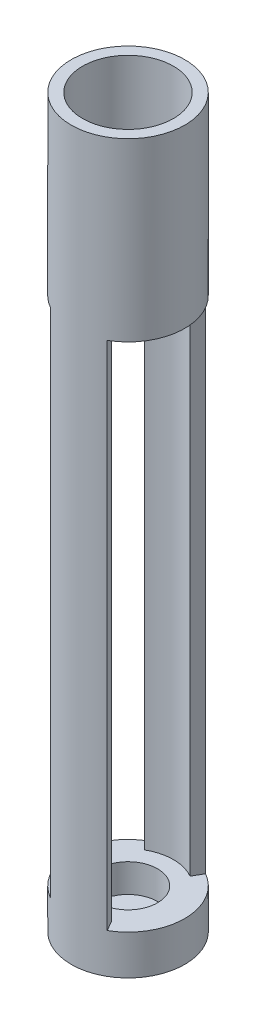
ISO-10303-21;
HEADER;
FILE_DESCRIPTION(('STEP AP214'),'2;1');
FILE_NAME('part.step','',(''),(''),'','','');
FILE_SCHEMA(('AUTOMOTIVE_DESIGN { 1 0 10303 214 1 1 1 1 }'));
ENDSEC;
DATA;
#1=APPLICATION_CONTEXT('core data for automotive mechanical design processes');
#2=APPLICATION_PROTOCOL_DEFINITION('international standard','automotive_design',2000,#1);
#3=PRODUCT_CONTEXT('',#1,'mechanical');
#4=PRODUCT('Part','Part','',(#3));
#5=PRODUCT_RELATED_PRODUCT_CATEGORY('part','',(#4));
#6=PRODUCT_DEFINITION_FORMATION('','',#4);
#7=PRODUCT_DEFINITION_CONTEXT('part definition',#1,'design');
#8=PRODUCT_DEFINITION('design','',#6,#7);
#9=PRODUCT_DEFINITION_SHAPE('','',#8);
#10=(LENGTH_UNIT() NAMED_UNIT(*) SI_UNIT(.MILLI.,.METRE.));
#11=(NAMED_UNIT(*) PLANE_ANGLE_UNIT() SI_UNIT($,.RADIAN.));
#12=(NAMED_UNIT(*) SI_UNIT($,.STERADIAN.) SOLID_ANGLE_UNIT());
#13=UNCERTAINTY_MEASURE_WITH_UNIT(LENGTH_MEASURE(1.E-05),#10,'distance_accuracy_value','');
#14=(GEOMETRIC_REPRESENTATION_CONTEXT(3) GLOBAL_UNCERTAINTY_ASSIGNED_CONTEXT((#13)) GLOBAL_UNIT_ASSIGNED_CONTEXT((#10,
#11,#12)) REPRESENTATION_CONTEXT('',''));
#15=CARTESIAN_POINT('',(0.,0.,0.));
#16=DIRECTION('',(0.,0.,1.));
#17=DIRECTION('',(1.,0.,0.));
#18=AXIS2_PLACEMENT_3D('',#15,#16,#17);
#19=CARTESIAN_POINT('',(0.,54.,0.));
#20=DIRECTION('',(0.,1.,0.));
#21=DIRECTION('',(0.,0.,1.));
#22=AXIS2_PLACEMENT_3D('',#19,#20,#21);
#23=PLANE('',#22);
#24=CARTESIAN_POINT('',(0.,54.,0.));
#25=DIRECTION('',(0.,1.,0.));
#26=DIRECTION('',(0.,0.,1.));
#27=AXIS2_PLACEMENT_3D('',#24,#25,#26);
#28=CIRCLE('',#27,2.6);
#29=CARTESIAN_POINT('',(0.,54.,2.6));
#30=VERTEX_POINT('',#29);
#31=EDGE_CURVE('E274',#30,#30,#28,.T.);
#32=ORIENTED_EDGE('',*,*,#31,.F.);
#33=EDGE_LOOP('',(#32));
#34=FACE_BOUND('',#33,.T.);
#35=CARTESIAN_POINT('',(0.,54.,3.));
#36=DIRECTION('',(0.,1.,0.));
#37=DIRECTION('',(0.,0.,1.));
#38=AXIS2_PLACEMENT_3D('',#35,#36,#37);
#39=CIRCLE('',#38,0.2);
#40=CARTESIAN_POINT('',(0.,54.,3.2));
#41=VERTEX_POINT('',#40);
#42=EDGE_CURVE('E306',#41,#41,#39,.F.);
#43=ORIENTED_EDGE('',*,*,#42,.T.);
#44=EDGE_LOOP('',(#43));
#45=FACE_BOUND('',#44,.T.);
#46=CARTESIAN_POINT('',(-2.59807621135332,54.,1.49999999999999));
#47=DIRECTION('',(0.,1.,0.));
#48=DIRECTION('',(0.,0.,1.));
#49=AXIS2_PLACEMENT_3D('',#46,#47,#48);
#50=CIRCLE('',#49,0.2);
#51=CARTESIAN_POINT('',(-2.59807621135332,54.,1.69999999999999));
#52=VERTEX_POINT('',#51);
#53=EDGE_CURVE('E340',#52,#52,#50,.F.);
#54=ORIENTED_EDGE('',*,*,#53,.T.);
#55=EDGE_LOOP('',(#54));
#56=FACE_BOUND('',#55,.T.);
#57=CARTESIAN_POINT('',(-2.59807621135331,54.,-1.50000000000001));
#58=DIRECTION('',(0.,1.,0.));
#59=DIRECTION('',(0.,0.,1.));
#60=AXIS2_PLACEMENT_3D('',#57,#58,#59);
#61=CIRCLE('',#60,0.2);
#62=CARTESIAN_POINT('',(-2.59807621135331,54.,-1.30000000000001));
#63=VERTEX_POINT('',#62);
#64=EDGE_CURVE('E344',#63,#63,#61,.F.);
#65=ORIENTED_EDGE('',*,*,#64,.T.);
#66=EDGE_LOOP('',(#65));
#67=FACE_BOUND('',#66,.T.);
#68=CARTESIAN_POINT('',(0.,54.,-3.));
#69=DIRECTION('',(0.,1.,0.));
#70=DIRECTION('',(0.,0.,1.));
#71=AXIS2_PLACEMENT_3D('',#68,#69,#70);
#72=CIRCLE('',#71,0.2);
#73=CARTESIAN_POINT('',(0.,54.,-2.8));
#74=VERTEX_POINT('',#73);
#75=EDGE_CURVE('E348',#74,#74,#72,.F.);
#76=ORIENTED_EDGE('',*,*,#75,.T.);
#77=EDGE_LOOP('',(#76));
#78=FACE_BOUND('',#77,.T.);
#79=CARTESIAN_POINT('',(2.59807621135333,54.,-1.49999999999998));
#80=DIRECTION('',(0.,1.,0.));
#81=DIRECTION('',(0.,0.,1.));
#82=AXIS2_PLACEMENT_3D('',#79,#80,#81);
#83=CIRCLE('',#82,0.2);
#84=CARTESIAN_POINT('',(2.59807621135333,54.,-1.29999999999998));
#85=VERTEX_POINT('',#84);
#86=EDGE_CURVE('E352',#85,#85,#83,.F.);
#87=ORIENTED_EDGE('',*,*,#86,.T.);
#88=EDGE_LOOP('',(#87));
#89=FACE_BOUND('',#88,.T.);
#90=CARTESIAN_POINT('',(2.5980762113533,54.,1.50000000000003));
#91=DIRECTION('',(0.,1.,0.));
#92=DIRECTION('',(0.,0.,1.));
#93=AXIS2_PLACEMENT_3D('',#90,#91,#92);
#94=CIRCLE('',#93,0.2);
#95=CARTESIAN_POINT('',(2.5980762113533,54.,1.70000000000003));
#96=VERTEX_POINT('',#95);
#97=EDGE_CURVE('E356',#96,#96,#94,.F.);
#98=ORIENTED_EDGE('',*,*,#97,.T.);
#99=EDGE_LOOP('',(#98));
#100=FACE_BOUND('',#99,.T.);
#101=CARTESIAN_POINT('',(0.,54.,0.));
#102=DIRECTION('',(0.,1.,0.));
#103=DIRECTION('',(0.,0.,1.));
#104=AXIS2_PLACEMENT_3D('',#101,#102,#103);
#105=CIRCLE('',#104,4.);
#106=CARTESIAN_POINT('',(0.,54.,4.));
#107=VERTEX_POINT('',#106);
#108=EDGE_CURVE('E11',#107,#107,#105,.F.);
#109=ORIENTED_EDGE('',*,*,#108,.F.);
#110=EDGE_LOOP('',(#109));
#111=FACE_BOUND('',#110,.T.);
#112=ADVANCED_FACE('F43',(#34,#45,#56,#67,#78,#89,#100,#111),#23,.T.);
#113=CARTESIAN_POINT('',(0.,51.5,0.));
#114=DIRECTION('',(0.,1.,0.));
#115=DIRECTION('',(0.,0.,1.));
#116=AXIS2_PLACEMENT_3D('',#113,#114,#115);
#117=PLANE('',#116);
#118=CARTESIAN_POINT('',(0.,51.5,0.));
#119=DIRECTION('',(0.,1.,0.));
#120=DIRECTION('',(0.,0.,1.));
#121=AXIS2_PLACEMENT_3D('',#118,#119,#120);
#122=CIRCLE('',#121,1.3);
#123=CARTESIAN_POINT('',(0.,51.5,1.3));
#124=VERTEX_POINT('',#123);
#125=EDGE_CURVE('E146',#124,#124,#122,.T.);
#126=ORIENTED_EDGE('',*,*,#125,.F.);
#127=EDGE_LOOP('',(#126));
#128=FACE_BOUND('',#127,.T.);
#129=CARTESIAN_POINT('',(0.,51.5,0.));
#130=DIRECTION('',(0.,1.,0.));
#131=DIRECTION('',(0.,0.,1.));
#132=AXIS2_PLACEMENT_3D('',#129,#130,#131);
#133=CIRCLE('',#132,2.6);
#134=CARTESIAN_POINT('',(0.,51.5,2.6));
#135=VERTEX_POINT('',#134);
#136=EDGE_CURVE('E278',#135,#135,#133,.T.);
#137=ORIENTED_EDGE('',*,*,#136,.T.);
#138=EDGE_LOOP('',(#137));
#139=FACE_BOUND('',#138,.T.);
#140=ADVANCED_FACE('F246',(#128,#139),#117,.T.);
#141=CARTESIAN_POINT('',(0.,3.5,0.));
#142=DIRECTION('',(0.,1.,0.));
#143=DIRECTION('',(0.,0.,1.));
#144=AXIS2_PLACEMENT_3D('',#141,#142,#143);
#145=PLANE('',#144);
#146=DIRECTION('',(-0.5,0.,0.866025403784439));
#147=VECTOR('',#146,1.);
#148=CARTESIAN_POINT('',(0.,3.5,0.));
#149=LINE('',#148,#147);
#150=CARTESIAN_POINT('',(2.5,3.5,-4.33012701892219));
#151=VERTEX_POINT('',#150);
#152=CARTESIAN_POINT('',(2.,3.5,-3.46410161513775));
#153=VERTEX_POINT('',#152);
#154=EDGE_CURVE('E59',#151,#153,#149,.T.);
#155=ORIENTED_EDGE('',*,*,#154,.T.);
#156=CARTESIAN_POINT('',(0.,3.5,0.));
#157=DIRECTION('',(0.,1.,0.));
#158=DIRECTION('',(0.,0.,1.));
#159=AXIS2_PLACEMENT_3D('',#156,#157,#158);
#160=CIRCLE('',#159,4.);
#161=CARTESIAN_POINT('',(-2.,3.5,-3.46410161513775));
#162=VERTEX_POINT('',#161);
#163=EDGE_CURVE('E64',#153,#162,#160,.T.);
#164=ORIENTED_EDGE('',*,*,#163,.T.);
#165=DIRECTION('',(0.5,0.,0.866025403784439));
#166=VECTOR('',#165,1.);
#167=CARTESIAN_POINT('',(0.,3.5,0.));
#168=LINE('',#167,#166);
#169=CARTESIAN_POINT('',(-2.5,3.5,-4.33012701892219));
#170=VERTEX_POINT('',#169);
#171=EDGE_CURVE('E155',#170,#162,#168,.T.);
#172=ORIENTED_EDGE('',*,*,#171,.F.);
#173=CARTESIAN_POINT('',(0.,3.5,0.));
#174=DIRECTION('',(0.,1.,0.));
#175=DIRECTION('',(0.,0.,1.));
#176=AXIS2_PLACEMENT_3D('',#173,#174,#175);
#177=CIRCLE('',#176,5.);
#178=CARTESIAN_POINT('',(-2.5,3.5,4.33012701892219));
#179=VERTEX_POINT('',#178);
#180=EDGE_CURVE('E213',#170,#179,#177,.T.);
#181=ORIENTED_EDGE('',*,*,#180,.T.);
#182=DIRECTION('',(0.5,0.,-0.866025403784439));
#183=VECTOR('',#182,1.);
#184=CARTESIAN_POINT('',(0.,3.5,0.));
#185=LINE('',#184,#183);
#186=CARTESIAN_POINT('',(-2.,3.5,3.46410161513775));
#187=VERTEX_POINT('',#186);
#188=EDGE_CURVE('E122',#179,#187,#185,.T.);
#189=ORIENTED_EDGE('',*,*,#188,.T.);
#190=CARTESIAN_POINT('',(0.,3.5,0.));
#191=DIRECTION('',(0.,1.,0.));
#192=DIRECTION('',(0.,0.,1.));
#193=AXIS2_PLACEMENT_3D('',#190,#191,#192);
#194=CIRCLE('',#193,4.);
#195=CARTESIAN_POINT('',(2.,3.5,3.46410161513775));
#196=VERTEX_POINT('',#195);
#197=EDGE_CURVE('E188',#196,#187,#194,.F.);
#198=ORIENTED_EDGE('',*,*,#197,.F.);
#199=DIRECTION('',(-0.5,0.,-0.866025403784439));
#200=VECTOR('',#199,1.);
#201=CARTESIAN_POINT('',(0.,3.5,0.));
#202=LINE('',#201,#200);
#203=CARTESIAN_POINT('',(2.5,3.5,4.33012701892219));
#204=VERTEX_POINT('',#203);
#205=EDGE_CURVE('E179',#204,#196,#202,.T.);
#206=ORIENTED_EDGE('',*,*,#205,.F.);
#207=EDGE_CURVE('E52',#204,#151,#177,.T.);
#208=ORIENTED_EDGE('',*,*,#207,.T.);
#209=EDGE_LOOP('',(#155,#164,#172,#181,#189,#198,#206,#208));
#210=FACE_BOUND('',#209,.T.);
#211=CARTESIAN_POINT('',(0.,3.5,0.));
#212=DIRECTION('',(0.,1.,0.));
#213=DIRECTION('',(0.,0.,1.));
#214=AXIS2_PLACEMENT_3D('',#211,#212,#213);
#215=CIRCLE('',#214,2.6);
#216=CARTESIAN_POINT('',(0.,3.5,2.6));
#217=VERTEX_POINT('',#216);
#218=EDGE_CURVE('E203',#217,#217,#215,.T.);
#219=ORIENTED_EDGE('',*,*,#218,.F.);
#220=EDGE_LOOP('',(#219));
#221=FACE_BOUND('',#220,.T.);
#222=ADVANCED_FACE('F219',(#210,#221),#145,.T.);
#223=CARTESIAN_POINT('',(0.,3.5,0.));
#224=DIRECTION('',(0.,-1.,0.));
#225=DIRECTION('',(0.,0.,-1.));
#226=AXIS2_PLACEMENT_3D('',#223,#224,#225);
#227=CYLINDRICAL_SURFACE('',#226,5.);
#228=DIRECTION('',(0.,-1.,0.));
#229=VECTOR('',#228,1.);
#230=CARTESIAN_POINT('',(2.5,48.5,4.33012701892219));
#231=LINE('',#230,#229);
#232=CARTESIAN_POINT('',(2.5,48.5,4.33012701892219));
#233=VERTEX_POINT('',#232);
#234=EDGE_CURVE('E114',#233,#204,#231,.T.);
#235=ORIENTED_EDGE('',*,*,#234,.F.);
#236=CARTESIAN_POINT('',(0.,48.5,0.));
#237=DIRECTION('',(0.,1.,0.));
#238=DIRECTION('',(0.,0.,1.));
#239=AXIS2_PLACEMENT_3D('',#236,#237,#238);
#240=CIRCLE('',#239,5.);
#241=CARTESIAN_POINT('',(2.5,48.5,-4.33012701892219));
#242=VERTEX_POINT('',#241);
#243=EDGE_CURVE('E129',#233,#242,#240,.T.);
#244=ORIENTED_EDGE('',*,*,#243,.T.);
#245=DIRECTION('',(0.,-1.,0.));
#246=VECTOR('',#245,1.);
#247=CARTESIAN_POINT('',(2.5,48.5,-4.33012701892219));
#248=LINE('',#247,#246);
#249=EDGE_CURVE('E174',#242,#151,#248,.T.);
#250=ORIENTED_EDGE('',*,*,#249,.T.);
#251=ORIENTED_EDGE('',*,*,#207,.F.);
#252=EDGE_LOOP('',(#235,#244,#250,#251));
#253=FACE_BOUND('',#252,.T.);
#254=CARTESIAN_POINT('',(-2.5,48.5,-4.33012701892219));
#255=VERTEX_POINT('',#254);
#256=CARTESIAN_POINT('',(-2.5,48.5,4.33012701892219));
#257=VERTEX_POINT('',#256);
#258=EDGE_CURVE('E140',#255,#257,#240,.T.);
#259=ORIENTED_EDGE('',*,*,#258,.T.);
#260=DIRECTION('',(0.,-1.,0.));
#261=VECTOR('',#260,1.);
#262=CARTESIAN_POINT('',(-2.5,48.5,4.33012701892219));
#263=LINE('',#262,#261);
#264=EDGE_CURVE('E131',#257,#179,#263,.T.);
#265=ORIENTED_EDGE('',*,*,#264,.T.);
#266=ORIENTED_EDGE('',*,*,#180,.F.);
#267=DIRECTION('',(0.,-1.,0.));
#268=VECTOR('',#267,1.);
#269=CARTESIAN_POINT('',(-2.5,48.5,-4.33012701892219));
#270=LINE('',#269,#268);
#271=EDGE_CURVE('E170',#255,#170,#270,.T.);
#272=ORIENTED_EDGE('',*,*,#271,.F.);
#273=EDGE_LOOP('',(#259,#265,#266,#272));
#274=FACE_BOUND('',#273,.T.);
#275=CARTESIAN_POINT('',(0.,0.,0.));
#276=DIRECTION('',(0.,1.,0.));
#277=DIRECTION('',(0.,0.,1.));
#278=AXIS2_PLACEMENT_3D('',#275,#276,#277);
#279=CIRCLE('',#278,5.);
#280=CARTESIAN_POINT('',(0.,0.,5.));
#281=VERTEX_POINT('',#280);
#282=EDGE_CURVE('E208',#281,#281,#279,.T.);
#283=ORIENTED_EDGE('',*,*,#282,.T.);
#284=EDGE_LOOP('',(#283));
#285=FACE_BOUND('',#284,.T.);
#286=CARTESIAN_POINT('',(0.,64.,0.));
#287=DIRECTION('',(0.,1.,0.));
#288=DIRECTION('',(0.,0.,1.));
#289=AXIS2_PLACEMENT_3D('',#286,#287,#288);
#290=CIRCLE('',#289,5.);
#291=CARTESIAN_POINT('',(0.,64.,5.));
#292=VERTEX_POINT('',#291);
#293=EDGE_CURVE('E370',#292,#292,#290,.T.);
#294=ORIENTED_EDGE('',*,*,#293,.F.);
#295=EDGE_LOOP('',(#294));
#296=FACE_BOUND('',#295,.T.);
#297=ADVANCED_FACE('F45',(#253,#274,#285,#296),#227,.T.);
#298=CARTESIAN_POINT('',(0.,0.,0.));
#299=DIRECTION('',(0.,1.,0.));
#300=DIRECTION('',(0.,0.,1.));
#301=AXIS2_PLACEMENT_3D('',#298,#299,#300);
#302=PLANE('',#301);
#303=ORIENTED_EDGE('',*,*,#282,.F.);
#304=EDGE_LOOP('',(#303));
#305=FACE_BOUND('',#304,.T.);
#306=ADVANCED_FACE('F560',(#305),#302,.F.);
#307=CARTESIAN_POINT('',(0.,1.,0.));
#308=DIRECTION('',(0.,1.,0.));
#309=DIRECTION('',(0.,0.,1.));
#310=AXIS2_PLACEMENT_3D('',#307,#308,#309);
#311=CYLINDRICAL_SURFACE('',#310,2.6);
#312=CARTESIAN_POINT('',(0.,1.,0.));
#313=DIRECTION('',(0.,1.,0.));
#314=DIRECTION('',(0.,0.,1.));
#315=AXIS2_PLACEMENT_3D('',#312,#313,#314);
#316=CIRCLE('',#315,2.6);
#317=CARTESIAN_POINT('',(0.,1.,2.6));
#318=VERTEX_POINT('',#317);
#319=EDGE_CURVE('E204',#318,#318,#316,.T.);
#320=ORIENTED_EDGE('',*,*,#319,.F.);
#321=EDGE_LOOP('',(#320));
#322=FACE_BOUND('',#321,.T.);
#323=ORIENTED_EDGE('',*,*,#218,.T.);
#324=EDGE_LOOP('',(#323));
#325=FACE_BOUND('',#324,.T.);
#326=ADVANCED_FACE('F582',(#322,#325),#311,.F.);
#327=CARTESIAN_POINT('',(0.,1.,0.));
#328=DIRECTION('',(0.,1.,0.));
#329=DIRECTION('',(0.,0.,1.));
#330=AXIS2_PLACEMENT_3D('',#327,#328,#329);
#331=PLANE('',#330);
#332=ORIENTED_EDGE('',*,*,#319,.T.);
#333=EDGE_LOOP('',(#332));
#334=FACE_BOUND('',#333,.T.);
#335=ADVANCED_FACE('F589',(#334),#331,.T.);
#336=CARTESIAN_POINT('',(0.,48.5,0.));
#337=DIRECTION('',(-0.866025403784439,0.,0.5));
#338=DIRECTION('',(0.5,0.,0.866025403784439));
#339=AXIS2_PLACEMENT_3D('',#336,#337,#338);
#340=PLANE('',#339);
#341=ORIENTED_EDGE('',*,*,#205,.T.);
#342=DIRECTION('',(0.,-1.,0.));
#343=VECTOR('',#342,1.);
#344=CARTESIAN_POINT('',(2.,48.5,3.46410161513775));
#345=LINE('',#344,#343);
#346=CARTESIAN_POINT('',(2.,48.5,3.46410161513775));
#347=VERTEX_POINT('',#346);
#348=EDGE_CURVE('E116',#347,#196,#345,.T.);
#349=ORIENTED_EDGE('',*,*,#348,.F.);
#350=DIRECTION('',(-0.5,0.,-0.866025403784439));
#351=VECTOR('',#350,1.);
#352=CARTESIAN_POINT('',(0.,48.5,0.));
#353=LINE('',#352,#351);
#354=EDGE_CURVE('E110',#233,#347,#353,.T.);
#355=ORIENTED_EDGE('',*,*,#354,.F.);
#356=ORIENTED_EDGE('',*,*,#234,.T.);
#357=EDGE_LOOP('',(#341,#349,#355,#356));
#358=FACE_BOUND('',#357,.T.);
#359=ADVANCED_FACE('F113',(#358),#340,.F.);
#360=CARTESIAN_POINT('',(0.,48.5,0.));
#361=DIRECTION('',(0.,-1.,0.));
#362=DIRECTION('',(0.,0.,-1.));
#363=AXIS2_PLACEMENT_3D('',#360,#361,#362);
#364=CYLINDRICAL_SURFACE('',#363,4.);
#365=ORIENTED_EDGE('',*,*,#197,.T.);
#366=DIRECTION('',(0.,-1.,0.));
#367=VECTOR('',#366,1.);
#368=CARTESIAN_POINT('',(-2.,48.5,3.46410161513775));
#369=LINE('',#368,#367);
#370=CARTESIAN_POINT('',(-2.,48.5,3.46410161513775));
#371=VERTEX_POINT('',#370);
#372=EDGE_CURVE('E197',#371,#187,#369,.T.);
#373=ORIENTED_EDGE('',*,*,#372,.F.);
#374=CARTESIAN_POINT('',(0.,48.5,0.));
#375=DIRECTION('',(0.,1.,0.));
#376=DIRECTION('',(0.,0.,1.));
#377=AXIS2_PLACEMENT_3D('',#374,#375,#376);
#378=CIRCLE('',#377,4.);
#379=EDGE_CURVE('E121',#347,#371,#378,.F.);
#380=ORIENTED_EDGE('',*,*,#379,.F.);
#381=ORIENTED_EDGE('',*,*,#348,.T.);
#382=EDGE_LOOP('',(#365,#373,#380,#381));
#383=FACE_BOUND('',#382,.T.);
#384=ADVANCED_FACE('F228',(#383),#364,.F.);
#385=CARTESIAN_POINT('',(0.,48.5,0.));
#386=DIRECTION('',(-0.866025403784439,0.,-0.5));
#387=DIRECTION('',(-0.5,0.,0.866025403784439));
#388=AXIS2_PLACEMENT_3D('',#385,#386,#387);
#389=PLANE('',#388);
#390=ORIENTED_EDGE('',*,*,#188,.F.);
#391=ORIENTED_EDGE('',*,*,#264,.F.);
#392=DIRECTION('',(0.5,0.,-0.866025403784439));
#393=VECTOR('',#392,1.);
#394=CARTESIAN_POINT('',(0.,48.5,0.));
#395=LINE('',#394,#393);
#396=EDGE_CURVE('E132',#257,#371,#395,.T.);
#397=ORIENTED_EDGE('',*,*,#396,.T.);
#398=ORIENTED_EDGE('',*,*,#372,.T.);
#399=EDGE_LOOP('',(#390,#391,#397,#398));
#400=FACE_BOUND('',#399,.T.);
#401=ADVANCED_FACE('F226',(#400),#389,.T.);
#402=CARTESIAN_POINT('',(0.,48.5,0.));
#403=DIRECTION('',(0.,-1.,0.));
#404=DIRECTION('',(0.,0.,-1.));
#405=AXIS2_PLACEMENT_3D('',#402,#403,#404);
#406=CYLINDRICAL_SURFACE('',#405,4.);
#407=ORIENTED_EDGE('',*,*,#163,.F.);
#408=DIRECTION('',(0.,-1.,0.));
#409=VECTOR('',#408,1.);
#410=CARTESIAN_POINT('',(2.,48.5,-3.46410161513775));
#411=LINE('',#410,#409);
#412=CARTESIAN_POINT('',(2.,48.5,-3.46410161513775));
#413=VERTEX_POINT('',#412);
#414=EDGE_CURVE('E177',#413,#153,#411,.T.);
#415=ORIENTED_EDGE('',*,*,#414,.F.);
#416=CARTESIAN_POINT('',(0.,48.5,0.));
#417=DIRECTION('',(0.,1.,0.));
#418=DIRECTION('',(0.,0.,1.));
#419=AXIS2_PLACEMENT_3D('',#416,#417,#418);
#420=CIRCLE('',#419,4.);
#421=CARTESIAN_POINT('',(-2.,48.5,-3.46410161513775));
#422=VERTEX_POINT('',#421);
#423=EDGE_CURVE('E151',#413,#422,#420,.T.);
#424=ORIENTED_EDGE('',*,*,#423,.T.);
#425=DIRECTION('',(0.,-1.,0.));
#426=VECTOR('',#425,1.);
#427=CARTESIAN_POINT('',(-2.,48.5,-3.46410161513775));
#428=LINE('',#427,#426);
#429=EDGE_CURVE('E161',#422,#162,#428,.T.);
#430=ORIENTED_EDGE('',*,*,#429,.T.);
#431=EDGE_LOOP('',(#407,#415,#424,#430));
#432=FACE_BOUND('',#431,.T.);
#433=ADVANCED_FACE('F232',(#432),#406,.F.);
#434=CARTESIAN_POINT('',(0.,48.5,0.));
#435=DIRECTION('',(0.866025403784439,0.,0.5));
#436=DIRECTION('',(0.5,0.,-0.866025403784439));
#437=AXIS2_PLACEMENT_3D('',#434,#435,#436);
#438=PLANE('',#437);
#439=ORIENTED_EDGE('',*,*,#154,.F.);
#440=ORIENTED_EDGE('',*,*,#249,.F.);
#441=DIRECTION('',(-0.5,0.,0.866025403784439));
#442=VECTOR('',#441,1.);
#443=CARTESIAN_POINT('',(0.,48.5,0.));
#444=LINE('',#443,#442);
#445=EDGE_CURVE('E138',#242,#413,#444,.T.);
#446=ORIENTED_EDGE('',*,*,#445,.T.);
#447=ORIENTED_EDGE('',*,*,#414,.T.);
#448=EDGE_LOOP('',(#439,#440,#446,#447));
#449=FACE_BOUND('',#448,.T.);
#450=ADVANCED_FACE('F230',(#449),#438,.T.);
#451=CARTESIAN_POINT('',(0.,48.5,0.));
#452=DIRECTION('',(0.866025403784439,0.,-0.5));
#453=DIRECTION('',(-0.5,0.,-0.866025403784439));
#454=AXIS2_PLACEMENT_3D('',#451,#452,#453);
#455=PLANE('',#454);
#456=ORIENTED_EDGE('',*,*,#171,.T.);
#457=ORIENTED_EDGE('',*,*,#429,.F.);
#458=DIRECTION('',(0.5,0.,0.866025403784439));
#459=VECTOR('',#458,1.);
#460=CARTESIAN_POINT('',(0.,48.5,0.));
#461=LINE('',#460,#459);
#462=EDGE_CURVE('E158',#255,#422,#461,.T.);
#463=ORIENTED_EDGE('',*,*,#462,.F.);
#464=ORIENTED_EDGE('',*,*,#271,.T.);
#465=EDGE_LOOP('',(#456,#457,#463,#464));
#466=FACE_BOUND('',#465,.T.);
#467=ADVANCED_FACE('F234',(#466),#455,.F.);
#468=CARTESIAN_POINT('',(0.,48.5,0.));
#469=DIRECTION('',(0.,1.,0.));
#470=DIRECTION('',(0.,0.,1.));
#471=AXIS2_PLACEMENT_3D('',#468,#469,#470);
#472=PLANE('',#471);
#473=CARTESIAN_POINT('',(2.16506350946108,48.5,1.25000000000003));
#474=DIRECTION('',(0.,-1.,0.));
#475=DIRECTION('',(-0.866025403784433,0.,-0.50000000000001));
#476=AXIS2_PLACEMENT_3D('',#473,#474,#475);
#477=CIRCLE('',#476,1.);
#478=CARTESIAN_POINT('',(1.29903810567665,48.5,0.750000000000015));
#479=VERTEX_POINT('',#478);
#480=EDGE_CURVE('E301',#479,#479,#477,.T.);
#481=ORIENTED_EDGE('',*,*,#480,.F.);
#482=EDGE_LOOP('',(#481));
#483=FACE_BOUND('',#482,.T.);
#484=CARTESIAN_POINT('',(2.16506350946111,48.5,-1.24999999999998));
#485=DIRECTION('',(0.,-1.,0.));
#486=DIRECTION('',(-0.866025403784443,0.,0.499999999999992));
#487=AXIS2_PLACEMENT_3D('',#484,#485,#486);
#488=CIRCLE('',#487,1.);
#489=CARTESIAN_POINT('',(1.29903810567667,48.5,-0.749999999999988));
#490=VERTEX_POINT('',#489);
#491=EDGE_CURVE('E310',#490,#490,#488,.T.);
#492=ORIENTED_EDGE('',*,*,#491,.F.);
#493=EDGE_LOOP('',(#492));
#494=FACE_BOUND('',#493,.T.);
#495=CARTESIAN_POINT('',(0.,48.5,-2.5));
#496=DIRECTION('',(0.,-1.,0.));
#497=DIRECTION('',(0.,0.,1.));
#498=AXIS2_PLACEMENT_3D('',#495,#496,#497);
#499=CIRCLE('',#498,1.);
#500=CARTESIAN_POINT('',(0.,48.5,-1.5));
#501=VERTEX_POINT('',#500);
#502=EDGE_CURVE('E318',#501,#501,#499,.T.);
#503=ORIENTED_EDGE('',*,*,#502,.F.);
#504=EDGE_LOOP('',(#503));
#505=FACE_BOUND('',#504,.T.);
#506=CARTESIAN_POINT('',(-2.16506350946109,48.5,-1.25000000000001));
#507=DIRECTION('',(0.,-1.,0.));
#508=DIRECTION('',(0.866025403784436,0.,0.500000000000004));
#509=AXIS2_PLACEMENT_3D('',#506,#507,#508);
#510=CIRCLE('',#509,1.);
#511=CARTESIAN_POINT('',(-1.29903810567665,48.5,-0.750000000000006));
#512=VERTEX_POINT('',#511);
#513=EDGE_CURVE('E326',#512,#512,#510,.T.);
#514=ORIENTED_EDGE('',*,*,#513,.F.);
#515=EDGE_LOOP('',(#514));
#516=FACE_BOUND('',#515,.T.);
#517=CARTESIAN_POINT('',(-2.1650635094611,48.5,1.25));
#518=DIRECTION('',(0.,-1.,0.));
#519=DIRECTION('',(0.86602540378444,0.,-0.499999999999998));
#520=AXIS2_PLACEMENT_3D('',#517,#518,#519);
#521=CIRCLE('',#520,1.);
#522=CARTESIAN_POINT('',(-1.29903810567666,48.5,0.749999999999997));
#523=VERTEX_POINT('',#522);
#524=EDGE_CURVE('E293',#523,#523,#521,.T.);
#525=ORIENTED_EDGE('',*,*,#524,.F.);
#526=EDGE_LOOP('',(#525));
#527=FACE_BOUND('',#526,.T.);
#528=CARTESIAN_POINT('',(0.,48.5,2.5));
#529=DIRECTION('',(0.,-1.,0.));
#530=DIRECTION('',(0.,0.,-1.));
#531=AXIS2_PLACEMENT_3D('',#528,#529,#530);
#532=CIRCLE('',#531,1.);
#533=CARTESIAN_POINT('',(0.,48.5,1.5));
#534=VERTEX_POINT('',#533);
#535=EDGE_CURVE('E285',#534,#534,#532,.T.);
#536=ORIENTED_EDGE('',*,*,#535,.F.);
#537=EDGE_LOOP('',(#536));
#538=FACE_BOUND('',#537,.T.);
#539=CARTESIAN_POINT('',(0.,48.5,0.));
#540=DIRECTION('',(0.,1.,0.));
#541=DIRECTION('',(0.,0.,1.));
#542=AXIS2_PLACEMENT_3D('',#539,#540,#541);
#543=CIRCLE('',#542,1.3);
#544=CARTESIAN_POINT('',(0.,48.5,1.3));
#545=VERTEX_POINT('',#544);
#546=EDGE_CURVE('E149',#545,#545,#543,.T.);
#547=ORIENTED_EDGE('',*,*,#546,.T.);
#548=EDGE_LOOP('',(#547));
#549=FACE_BOUND('',#548,.T.);
#550=ORIENTED_EDGE('',*,*,#243,.F.);
#551=ORIENTED_EDGE('',*,*,#354,.T.);
#552=ORIENTED_EDGE('',*,*,#379,.T.);
#553=ORIENTED_EDGE('',*,*,#396,.F.);
#554=ORIENTED_EDGE('',*,*,#258,.F.);
#555=ORIENTED_EDGE('',*,*,#462,.T.);
#556=ORIENTED_EDGE('',*,*,#423,.F.);
#557=ORIENTED_EDGE('',*,*,#445,.F.);
#558=EDGE_LOOP('',(#550,#551,#552,#553,#554,#555,#556,#557));
#559=FACE_BOUND('',#558,.T.);
#560=ADVANCED_FACE('F135',(#483,#494,#505,#516,#527,#538,#549,#559),#472,.F.);
#561=CARTESIAN_POINT('',(0.,51.5,0.));
#562=DIRECTION('',(0.,-1.,0.));
#563=DIRECTION('',(0.,0.,-1.));
#564=AXIS2_PLACEMENT_3D('',#561,#562,#563);
#565=CYLINDRICAL_SURFACE('',#564,1.3);
#566=ORIENTED_EDGE('',*,*,#125,.T.);
#567=EDGE_LOOP('',(#566));
#568=FACE_BOUND('',#567,.T.);
#569=ORIENTED_EDGE('',*,*,#546,.F.);
#570=EDGE_LOOP('',(#569));
#571=FACE_BOUND('',#570,.T.);
#572=ADVANCED_FACE('F241',(#568,#571),#565,.F.);
#573=CARTESIAN_POINT('',(0.,54.,0.));
#574=DIRECTION('',(0.,-1.,0.));
#575=DIRECTION('',(0.,0.,-1.));
#576=AXIS2_PLACEMENT_3D('',#573,#574,#575);
#577=CYLINDRICAL_SURFACE('',#576,2.6);
#578=ORIENTED_EDGE('',*,*,#31,.T.);
#579=EDGE_LOOP('',(#578));
#580=FACE_BOUND('',#579,.T.);
#581=ORIENTED_EDGE('',*,*,#136,.F.);
#582=EDGE_LOOP('',(#581));
#583=FACE_BOUND('',#582,.T.);
#584=ADVANCED_FACE('F258',(#580,#583),#577,.F.);
#585=CARTESIAN_POINT('',(0.,50.5,2.5));
#586=DIRECTION('',(0.,-1.,0.));
#587=DIRECTION('',(0.,0.,-1.));
#588=AXIS2_PLACEMENT_3D('',#585,#586,#587);
#589=CYLINDRICAL_SURFACE('',#588,1.);
#590=CARTESIAN_POINT('',(0.,50.5,2.5));
#591=DIRECTION('',(0.,-1.,0.));
#592=DIRECTION('',(0.,0.,-1.));
#593=AXIS2_PLACEMENT_3D('',#590,#591,#592);
#594=CIRCLE('',#593,1.);
#595=CARTESIAN_POINT('',(0.,50.5,1.5));
#596=VERTEX_POINT('',#595);
#597=EDGE_CURVE('E282',#596,#596,#594,.T.);
#598=ORIENTED_EDGE('',*,*,#597,.F.);
#599=EDGE_LOOP('',(#598));
#600=FACE_BOUND('',#599,.T.);
#601=ORIENTED_EDGE('',*,*,#535,.T.);
#602=EDGE_LOOP('',(#601));
#603=FACE_BOUND('',#602,.T.);
#604=ADVANCED_FACE('F265',(#600,#603),#589,.F.);
#605=CARTESIAN_POINT('',(0.,50.5,2.5));
#606=DIRECTION('',(0.,-1.,0.));
#607=DIRECTION('',(0.,0.,-1.));
#608=AXIS2_PLACEMENT_3D('',#605,#606,#607);
#609=PLANE('',#608);
#610=CARTESIAN_POINT('',(0.,50.5,3.));
#611=DIRECTION('',(0.,-1.,0.));
#612=DIRECTION('',(0.,0.,-1.));
#613=AXIS2_PLACEMENT_3D('',#610,#611,#612);
#614=CIRCLE('',#613,0.2);
#615=CARTESIAN_POINT('',(0.,50.5,2.8));
#616=VERTEX_POINT('',#615);
#617=EDGE_CURVE('E336',#616,#616,#614,.F.);
#618=ORIENTED_EDGE('',*,*,#617,.T.);
#619=EDGE_LOOP('',(#618));
#620=FACE_BOUND('',#619,.T.);
#621=ORIENTED_EDGE('',*,*,#597,.T.);
#622=EDGE_LOOP('',(#621));
#623=FACE_BOUND('',#622,.T.);
#624=ADVANCED_FACE('F464',(#620,#623),#609,.T.);
#625=CARTESIAN_POINT('',(-2.1650635094611,50.5,1.25));
#626=DIRECTION('',(0.,-1.,0.));
#627=DIRECTION('',(0.,0.,-1.));
#628=AXIS2_PLACEMENT_3D('',#625,#626,#627);
#629=CYLINDRICAL_SURFACE('',#628,1.);
#630=CARTESIAN_POINT('',(-2.1650635094611,50.5,1.25));
#631=DIRECTION('',(0.,-1.,0.));
#632=DIRECTION('',(0.86602540378444,0.,-0.499999999999998));
#633=AXIS2_PLACEMENT_3D('',#630,#631,#632);
#634=CIRCLE('',#633,1.);
#635=CARTESIAN_POINT('',(-1.29903810567666,50.5,0.749999999999997));
#636=VERTEX_POINT('',#635);
#637=EDGE_CURVE('E289',#636,#636,#634,.T.);
#638=ORIENTED_EDGE('',*,*,#637,.F.);
#639=EDGE_LOOP('',(#638));
#640=FACE_BOUND('',#639,.T.);
#641=ORIENTED_EDGE('',*,*,#524,.T.);
#642=EDGE_LOOP('',(#641));
#643=FACE_BOUND('',#642,.T.);
#644=ADVANCED_FACE('F460',(#640,#643),#629,.F.);
#645=CARTESIAN_POINT('',(-2.1650635094611,50.5,1.25));
#646=DIRECTION('',(0.,-1.,0.));
#647=DIRECTION('',(0.86602540378444,0.,-0.499999999999998));
#648=AXIS2_PLACEMENT_3D('',#645,#646,#647);
#649=PLANE('',#648);
#650=CARTESIAN_POINT('',(-2.59807621135332,50.5,1.49999999999999));
#651=DIRECTION('',(0.,-1.,0.));
#652=DIRECTION('',(0.,0.,-1.));
#653=AXIS2_PLACEMENT_3D('',#650,#651,#652);
#654=CIRCLE('',#653,0.2);
#655=CARTESIAN_POINT('',(-2.59807621135332,50.5,1.29999999999999));
#656=VERTEX_POINT('',#655);
#657=EDGE_CURVE('E360',#656,#656,#654,.F.);
#658=ORIENTED_EDGE('',*,*,#657,.T.);
#659=EDGE_LOOP('',(#658));
#660=FACE_BOUND('',#659,.T.);
#661=ORIENTED_EDGE('',*,*,#637,.T.);
#662=EDGE_LOOP('',(#661));
#663=FACE_BOUND('',#662,.T.);
#664=ADVANCED_FACE('F434',(#660,#663),#649,.T.);
#665=CARTESIAN_POINT('',(-2.16506350946109,50.5,-1.25000000000001));
#666=DIRECTION('',(0.,-1.,0.));
#667=DIRECTION('',(0.,0.,-1.));
#668=AXIS2_PLACEMENT_3D('',#665,#666,#667);
#669=CYLINDRICAL_SURFACE('',#668,1.);
#670=CARTESIAN_POINT('',(-2.16506350946109,50.5,-1.25000000000001));
#671=DIRECTION('',(0.,-1.,0.));
#672=DIRECTION('',(0.866025403784436,0.,0.500000000000004));
#673=AXIS2_PLACEMENT_3D('',#670,#671,#672);
#674=CIRCLE('',#673,1.);
#675=CARTESIAN_POINT('',(-1.29903810567665,50.5,-0.750000000000006));
#676=VERTEX_POINT('',#675);
#677=EDGE_CURVE('E297',#676,#676,#674,.T.);
#678=ORIENTED_EDGE('',*,*,#677,.F.);
#679=EDGE_LOOP('',(#678));
#680=FACE_BOUND('',#679,.T.);
#681=ORIENTED_EDGE('',*,*,#513,.T.);
#682=EDGE_LOOP('',(#681));
#683=FACE_BOUND('',#682,.T.);
#684=ADVANCED_FACE('F430',(#680,#683),#669,.F.);
#685=CARTESIAN_POINT('',(-2.16506350946109,50.5,-1.25000000000001));
#686=DIRECTION('',(0.,-1.,0.));
#687=DIRECTION('',(0.866025403784436,0.,0.500000000000004));
#688=AXIS2_PLACEMENT_3D('',#685,#686,#687);
#689=PLANE('',#688);
#690=CARTESIAN_POINT('',(-2.59807621135331,50.5,-1.50000000000001));
#691=DIRECTION('',(0.,-1.,0.));
#692=DIRECTION('',(0.,0.,-1.));
#693=AXIS2_PLACEMENT_3D('',#690,#691,#692);
#694=CIRCLE('',#693,0.2);
#695=CARTESIAN_POINT('',(-2.59807621135331,50.5,-1.70000000000001));
#696=VERTEX_POINT('',#695);
#697=EDGE_CURVE('E364',#696,#696,#694,.F.);
#698=ORIENTED_EDGE('',*,*,#697,.T.);
#699=EDGE_LOOP('',(#698));
#700=FACE_BOUND('',#699,.T.);
#701=ORIENTED_EDGE('',*,*,#677,.T.);
#702=EDGE_LOOP('',(#701));
#703=FACE_BOUND('',#702,.T.);
#704=ADVANCED_FACE('F426',(#700,#703),#689,.T.);
#705=CARTESIAN_POINT('',(0.,50.5,-2.5));
#706=DIRECTION('',(0.,-1.,0.));
#707=DIRECTION('',(0.,0.,-1.));
#708=AXIS2_PLACEMENT_3D('',#705,#706,#707);
#709=CYLINDRICAL_SURFACE('',#708,1.);
#710=CARTESIAN_POINT('',(0.,50.5,-2.5));
#711=DIRECTION('',(0.,-1.,0.));
#712=DIRECTION('',(0.,0.,1.));
#713=AXIS2_PLACEMENT_3D('',#710,#711,#712);
#714=CIRCLE('',#713,1.);
#715=CARTESIAN_POINT('',(0.,50.5,-1.5));
#716=VERTEX_POINT('',#715);
#717=EDGE_CURVE('E322',#716,#716,#714,.T.);
#718=ORIENTED_EDGE('',*,*,#717,.F.);
#719=EDGE_LOOP('',(#718));
#720=FACE_BOUND('',#719,.T.);
#721=ORIENTED_EDGE('',*,*,#502,.T.);
#722=EDGE_LOOP('',(#721));
#723=FACE_BOUND('',#722,.T.);
#724=ADVANCED_FACE('F429',(#720,#723),#709,.F.);
#725=CARTESIAN_POINT('',(0.,50.5,-2.5));
#726=DIRECTION('',(0.,-1.,0.));
#727=DIRECTION('',(0.,0.,1.));
#728=AXIS2_PLACEMENT_3D('',#725,#726,#727);
#729=PLANE('',#728);
#730=CARTESIAN_POINT('',(0.,50.5,-3.));
#731=DIRECTION('',(0.,-1.,0.));
#732=DIRECTION('',(0.,0.,-1.));
#733=AXIS2_PLACEMENT_3D('',#730,#731,#732);
#734=CIRCLE('',#733,0.2);
#735=CARTESIAN_POINT('',(0.,50.5,-3.2));
#736=VERTEX_POINT('',#735);
#737=EDGE_CURVE('E374',#736,#736,#734,.F.);
#738=ORIENTED_EDGE('',*,*,#737,.T.);
#739=EDGE_LOOP('',(#738));
#740=FACE_BOUND('',#739,.T.);
#741=ORIENTED_EDGE('',*,*,#717,.T.);
#742=EDGE_LOOP('',(#741));
#743=FACE_BOUND('',#742,.T.);
#744=ADVANCED_FACE('F436',(#740,#743),#729,.T.);
#745=CARTESIAN_POINT('',(2.16506350946111,50.5,-1.24999999999998));
#746=DIRECTION('',(0.,-1.,0.));
#747=DIRECTION('',(0.,0.,-1.));
#748=AXIS2_PLACEMENT_3D('',#745,#746,#747);
#749=CYLINDRICAL_SURFACE('',#748,1.);
#750=CARTESIAN_POINT('',(2.16506350946111,50.5,-1.24999999999998));
#751=DIRECTION('',(0.,-1.,0.));
#752=DIRECTION('',(-0.866025403784443,0.,0.499999999999992));
#753=AXIS2_PLACEMENT_3D('',#750,#751,#752);
#754=CIRCLE('',#753,1.);
#755=CARTESIAN_POINT('',(1.29903810567667,50.5,-0.749999999999988));
#756=VERTEX_POINT('',#755);
#757=EDGE_CURVE('E314',#756,#756,#754,.T.);
#758=ORIENTED_EDGE('',*,*,#757,.F.);
#759=EDGE_LOOP('',(#758));
#760=FACE_BOUND('',#759,.T.);
#761=ORIENTED_EDGE('',*,*,#491,.T.);
#762=EDGE_LOOP('',(#761));
#763=FACE_BOUND('',#762,.T.);
#764=ADVANCED_FACE('F439',(#760,#763),#749,.F.);
#765=CARTESIAN_POINT('',(2.16506350946111,50.5,-1.24999999999998));
#766=DIRECTION('',(0.,-1.,0.));
#767=DIRECTION('',(-0.866025403784443,0.,0.499999999999992));
#768=AXIS2_PLACEMENT_3D('',#765,#766,#767);
#769=PLANE('',#768);
#770=CARTESIAN_POINT('',(2.59807621135333,50.5,-1.49999999999998));
#771=DIRECTION('',(0.,-1.,0.));
#772=DIRECTION('',(0.,0.,-1.));
#773=AXIS2_PLACEMENT_3D('',#770,#771,#772);
#774=CIRCLE('',#773,0.2);
#775=CARTESIAN_POINT('',(2.59807621135333,50.5,-1.69999999999998));
#776=VERTEX_POINT('',#775);
#777=EDGE_CURVE('E369',#776,#776,#774,.F.);
#778=ORIENTED_EDGE('',*,*,#777,.T.);
#779=EDGE_LOOP('',(#778));
#780=FACE_BOUND('',#779,.T.);
#781=ORIENTED_EDGE('',*,*,#757,.T.);
#782=EDGE_LOOP('',(#781));
#783=FACE_BOUND('',#782,.T.);
#784=ADVANCED_FACE('F444',(#780,#783),#769,.T.);
#785=CARTESIAN_POINT('',(2.16506350946108,50.5,1.25000000000003));
#786=DIRECTION('',(0.,-1.,0.));
#787=DIRECTION('',(0.,0.,-1.));
#788=AXIS2_PLACEMENT_3D('',#785,#786,#787);
#789=CYLINDRICAL_SURFACE('',#788,1.);
#790=CARTESIAN_POINT('',(2.16506350946108,50.5,1.25000000000003));
#791=DIRECTION('',(0.,-1.,0.));
#792=DIRECTION('',(-0.866025403784433,0.,-0.50000000000001));
#793=AXIS2_PLACEMENT_3D('',#790,#791,#792);
#794=CIRCLE('',#793,1.);
#795=CARTESIAN_POINT('',(1.29903810567665,50.5,0.750000000000015));
#796=VERTEX_POINT('',#795);
#797=EDGE_CURVE('E305',#796,#796,#794,.T.);
#798=ORIENTED_EDGE('',*,*,#797,.F.);
#799=EDGE_LOOP('',(#798));
#800=FACE_BOUND('',#799,.T.);
#801=ORIENTED_EDGE('',*,*,#480,.T.);
#802=EDGE_LOOP('',(#801));
#803=FACE_BOUND('',#802,.T.);
#804=ADVANCED_FACE('F447',(#800,#803),#789,.F.);
#805=CARTESIAN_POINT('',(2.16506350946108,50.5,1.25000000000003));
#806=DIRECTION('',(0.,-1.,0.));
#807=DIRECTION('',(-0.866025403784433,0.,-0.50000000000001));
#808=AXIS2_PLACEMENT_3D('',#805,#806,#807);
#809=PLANE('',#808);
#810=CARTESIAN_POINT('',(2.5980762113533,50.5,1.50000000000003));
#811=DIRECTION('',(0.,-1.,0.));
#812=DIRECTION('',(0.,0.,-1.));
#813=AXIS2_PLACEMENT_3D('',#810,#811,#812);
#814=CIRCLE('',#813,0.2);
#815=CARTESIAN_POINT('',(2.5980762113533,50.5,1.30000000000003));
#816=VERTEX_POINT('',#815);
#817=EDGE_CURVE('E365',#816,#816,#814,.F.);
#818=ORIENTED_EDGE('',*,*,#817,.T.);
#819=EDGE_LOOP('',(#818));
#820=FACE_BOUND('',#819,.T.);
#821=ORIENTED_EDGE('',*,*,#797,.T.);
#822=EDGE_LOOP('',(#821));
#823=FACE_BOUND('',#822,.T.);
#824=ADVANCED_FACE('F424',(#820,#823),#809,.T.);
#825=CARTESIAN_POINT('',(0.,54.000012,3.));
#826=DIRECTION('',(0.,-1.,0.));
#827=DIRECTION('',(0.,0.,-1.));
#828=AXIS2_PLACEMENT_3D('',#825,#826,#827);
#829=CYLINDRICAL_SURFACE('',#828,0.2);
#830=ORIENTED_EDGE('',*,*,#42,.F.);
#831=EDGE_LOOP('',(#830));
#832=FACE_BOUND('',#831,.T.);
#833=ORIENTED_EDGE('',*,*,#617,.F.);
#834=EDGE_LOOP('',(#833));
#835=FACE_BOUND('',#834,.T.);
#836=ADVANCED_FACE('F419',(#832,#835),#829,.F.);
#837=CARTESIAN_POINT('',(2.5980762113533,54.000012,1.50000000000003));
#838=DIRECTION('',(0.,-1.,0.));
#839=DIRECTION('',(0.,0.,-1.));
#840=AXIS2_PLACEMENT_3D('',#837,#838,#839);
#841=CYLINDRICAL_SURFACE('',#840,0.2);
#842=ORIENTED_EDGE('',*,*,#97,.F.);
#843=EDGE_LOOP('',(#842));
#844=FACE_BOUND('',#843,.T.);
#845=ORIENTED_EDGE('',*,*,#817,.F.);
#846=EDGE_LOOP('',(#845));
#847=FACE_BOUND('',#846,.T.);
#848=ADVANCED_FACE('F416',(#844,#847),#841,.F.);
#849=CARTESIAN_POINT('',(2.59807621135333,54.000012,-1.49999999999998));
#850=DIRECTION('',(0.,-1.,0.));
#851=DIRECTION('',(0.,0.,-1.));
#852=AXIS2_PLACEMENT_3D('',#849,#850,#851);
#853=CYLINDRICAL_SURFACE('',#852,0.2);
#854=ORIENTED_EDGE('',*,*,#86,.F.);
#855=EDGE_LOOP('',(#854));
#856=FACE_BOUND('',#855,.T.);
#857=ORIENTED_EDGE('',*,*,#777,.F.);
#858=EDGE_LOOP('',(#857));
#859=FACE_BOUND('',#858,.T.);
#860=ADVANCED_FACE('F412',(#856,#859),#853,.F.);
#861=CARTESIAN_POINT('',(0.,54.000012,-3.));
#862=DIRECTION('',(0.,-1.,0.));
#863=DIRECTION('',(0.,0.,-1.));
#864=AXIS2_PLACEMENT_3D('',#861,#862,#863);
#865=CYLINDRICAL_SURFACE('',#864,0.2);
#866=ORIENTED_EDGE('',*,*,#75,.F.);
#867=EDGE_LOOP('',(#866));
#868=FACE_BOUND('',#867,.T.);
#869=ORIENTED_EDGE('',*,*,#737,.F.);
#870=EDGE_LOOP('',(#869));
#871=FACE_BOUND('',#870,.T.);
#872=ADVANCED_FACE('F408',(#868,#871),#865,.F.);
#873=CARTESIAN_POINT('',(-2.59807621135331,54.000012,-1.50000000000001));
#874=DIRECTION('',(0.,-1.,0.));
#875=DIRECTION('',(0.,0.,-1.));
#876=AXIS2_PLACEMENT_3D('',#873,#874,#875);
#877=CYLINDRICAL_SURFACE('',#876,0.2);
#878=ORIENTED_EDGE('',*,*,#64,.F.);
#879=EDGE_LOOP('',(#878));
#880=FACE_BOUND('',#879,.T.);
#881=ORIENTED_EDGE('',*,*,#697,.F.);
#882=EDGE_LOOP('',(#881));
#883=FACE_BOUND('',#882,.T.);
#884=ADVANCED_FACE('F402',(#880,#883),#877,.F.);
#885=CARTESIAN_POINT('',(-2.59807621135332,54.000012,1.49999999999999));
#886=DIRECTION('',(0.,-1.,0.));
#887=DIRECTION('',(0.,0.,-1.));
#888=AXIS2_PLACEMENT_3D('',#885,#886,#887);
#889=CYLINDRICAL_SURFACE('',#888,0.2);
#890=ORIENTED_EDGE('',*,*,#53,.F.);
#891=EDGE_LOOP('',(#890));
#892=FACE_BOUND('',#891,.T.);
#893=ORIENTED_EDGE('',*,*,#657,.F.);
#894=EDGE_LOOP('',(#893));
#895=FACE_BOUND('',#894,.T.);
#896=ADVANCED_FACE('F394',(#892,#895),#889,.F.);
#897=CARTESIAN_POINT('',(0.,64.,0.));
#898=DIRECTION('',(0.,1.,0.));
#899=DIRECTION('',(0.,0.,1.));
#900=AXIS2_PLACEMENT_3D('',#897,#898,#899);
#901=PLANE('',#900);
#902=ORIENTED_EDGE('',*,*,#293,.T.);
#903=EDGE_LOOP('',(#902));
#904=FACE_BOUND('',#903,.T.);
#905=CARTESIAN_POINT('',(0.,64.,0.));
#906=DIRECTION('',(0.,1.,0.));
#907=DIRECTION('',(0.,0.,1.));
#908=AXIS2_PLACEMENT_3D('',#905,#906,#907);
#909=CIRCLE('',#908,4.);
#910=CARTESIAN_POINT('',(0.,64.,4.));
#911=VERTEX_POINT('',#910);
#912=EDGE_CURVE('E384',#911,#911,#909,.T.);
#913=ORIENTED_EDGE('',*,*,#912,.F.);
#914=EDGE_LOOP('',(#913));
#915=FACE_BOUND('',#914,.T.);
#916=ADVANCED_FACE('F392',(#904,#915),#901,.T.);
#917=CARTESIAN_POINT('',(0.,64.,0.));
#918=DIRECTION('',(0.,-1.,0.));
#919=DIRECTION('',(0.,0.,-1.));
#920=AXIS2_PLACEMENT_3D('',#917,#918,#919);
#921=CYLINDRICAL_SURFACE('',#920,4.);
#922=ORIENTED_EDGE('',*,*,#912,.T.);
#923=EDGE_LOOP('',(#922));
#924=FACE_BOUND('',#923,.T.);
#925=ORIENTED_EDGE('',*,*,#108,.T.);
#926=EDGE_LOOP('',(#925));
#927=FACE_BOUND('',#926,.T.);
#928=ADVANCED_FACE('F389',(#924,#927),#921,.F.);
#929=CLOSED_SHELL('',(#112,#140,#222,#297,#306,#326,#335,#359,#384,#401,#433,#450,#467,#560,
#572,#584,#604,#624,#644,#664,#684,#704,#724,#744,#764,#784,#804,#824,#836,#848,#860,#872,#884,
#896,#916,#928));
#930=MANIFOLD_SOLID_BREP('B2',#929);
#931=ADVANCED_BREP_SHAPE_REPRESENTATION('',(#18,#930),#14);
#932=SHAPE_DEFINITION_REPRESENTATION(#9,#931);
ENDSEC;
END-ISO-10303-21;
